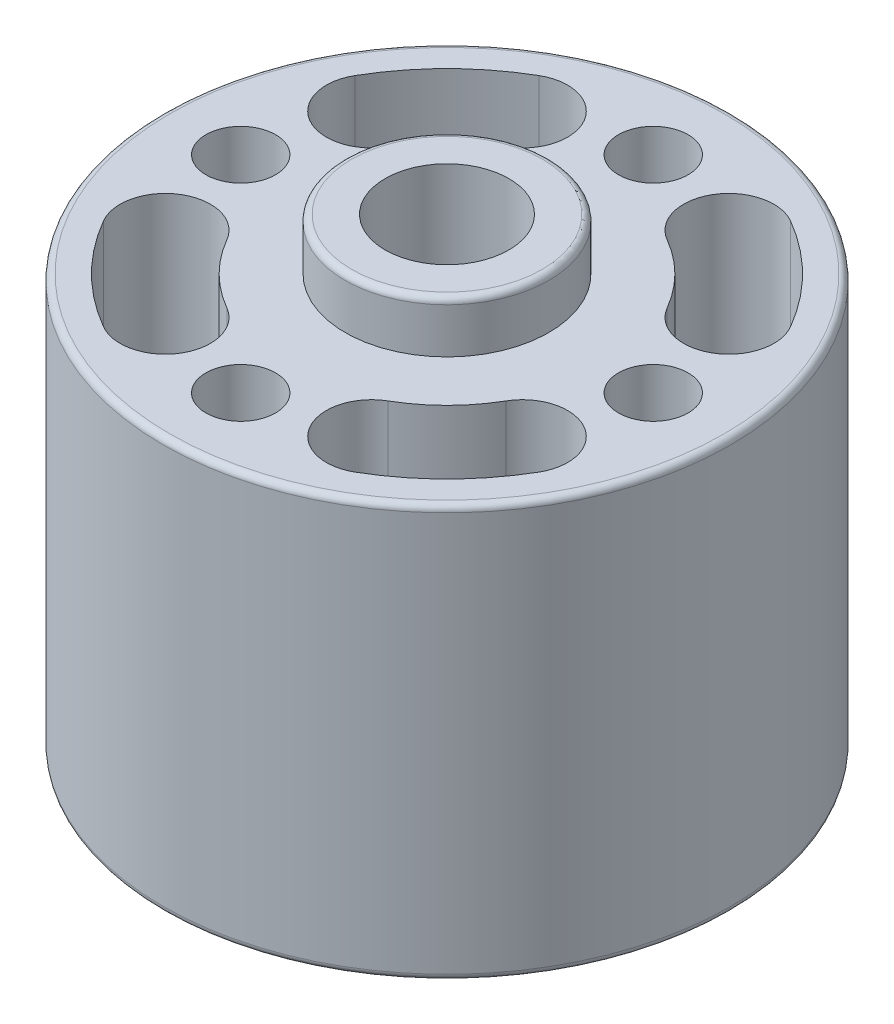
ISO-10303-21;
HEADER;
FILE_DESCRIPTION(('STEP AP214'),'2;1');
FILE_NAME('part.step','',(''),(''),'','','');
FILE_SCHEMA(('AUTOMOTIVE_DESIGN { 1 0 10303 214 1 1 1 1 }'));
ENDSEC;
DATA;
#1=APPLICATION_CONTEXT('core data for automotive mechanical design processes');
#2=APPLICATION_PROTOCOL_DEFINITION('international standard','automotive_design',2000,#1);
#3=PRODUCT_CONTEXT('',#1,'mechanical');
#4=PRODUCT('Part','Part','',(#3));
#5=PRODUCT_RELATED_PRODUCT_CATEGORY('part','',(#4));
#6=PRODUCT_DEFINITION_FORMATION('','',#4);
#7=PRODUCT_DEFINITION_CONTEXT('part definition',#1,'design');
#8=PRODUCT_DEFINITION('design','',#6,#7);
#9=PRODUCT_DEFINITION_SHAPE('','',#8);
#10=(LENGTH_UNIT() NAMED_UNIT(*) SI_UNIT(.MILLI.,.METRE.));
#11=(NAMED_UNIT(*) PLANE_ANGLE_UNIT() SI_UNIT($,.RADIAN.));
#12=(NAMED_UNIT(*) SI_UNIT($,.STERADIAN.) SOLID_ANGLE_UNIT());
#13=UNCERTAINTY_MEASURE_WITH_UNIT(LENGTH_MEASURE(1.E-05),#10,'distance_accuracy_value','');
#14=(GEOMETRIC_REPRESENTATION_CONTEXT(3) GLOBAL_UNCERTAINTY_ASSIGNED_CONTEXT((#13)) GLOBAL_UNIT_ASSIGNED_CONTEXT((#10,
#11,#12)) REPRESENTATION_CONTEXT('',''));
#15=CARTESIAN_POINT('',(0.,0.,0.));
#16=DIRECTION('',(0.,0.,1.));
#17=DIRECTION('',(1.,0.,0.));
#18=AXIS2_PLACEMENT_3D('',#15,#16,#17);
#19=CARTESIAN_POINT('',(0.,-10.,0.));
#20=DIRECTION('',(0.,1.,0.));
#21=DIRECTION('',(0.,0.,1.));
#22=AXIS2_PLACEMENT_3D('',#19,#20,#21);
#23=CYLINDRICAL_SURFACE('',#22,2.4);
#24=CARTESIAN_POINT('',(0.,10.,0.));
#25=DIRECTION('',(0.,1.,0.));
#26=DIRECTION('',(0.,0.,1.));
#27=AXIS2_PLACEMENT_3D('',#24,#25,#26);
#28=CIRCLE('',#27,2.4);
#29=CARTESIAN_POINT('',(0.,10.,2.4));
#30=VERTEX_POINT('',#29);
#31=EDGE_CURVE('E287',#30,#30,#28,.F.);
#32=ORIENTED_EDGE('',*,*,#31,.F.);
#33=EDGE_LOOP('',(#32));
#34=FACE_BOUND('',#33,.T.);
#35=CARTESIAN_POINT('',(0.,-10.,0.));
#36=DIRECTION('',(0.,1.,0.));
#37=DIRECTION('',(0.,0.,1.));
#38=AXIS2_PLACEMENT_3D('',#35,#36,#37);
#39=CIRCLE('',#38,2.4);
#40=CARTESIAN_POINT('',(0.,-10.,2.4));
#41=VERTEX_POINT('',#40);
#42=EDGE_CURVE('E283',#41,#41,#39,.F.);
#43=ORIENTED_EDGE('',*,*,#42,.T.);
#44=EDGE_LOOP('',(#43));
#45=FACE_BOUND('',#44,.T.);
#46=ADVANCED_FACE('F15',(#34,#45),#23,.F.);
#47=CARTESIAN_POINT('',(0.,10.,0.));
#48=DIRECTION('',(0.,1.,0.));
#49=DIRECTION('',(0.,0.,1.));
#50=AXIS2_PLACEMENT_3D('',#47,#48,#49);
#51=PLANE('',#50);
#52=ORIENTED_EDGE('',*,*,#31,.T.);
#53=EDGE_LOOP('',(#52));
#54=FACE_BOUND('',#53,.T.);
#55=CARTESIAN_POINT('',(0.,10.,0.));
#56=DIRECTION('',(0.,-1.,0.));
#57=DIRECTION('',(0.,0.,1.));
#58=AXIS2_PLACEMENT_3D('',#55,#56,#57);
#59=CIRCLE('',#58,3.7);
#60=CARTESIAN_POINT('',(0.,10.,3.7));
#61=VERTEX_POINT('',#60);
#62=CARTESIAN_POINT('',(0.,10.,-3.7));
#63=VERTEX_POINT('',#62);
#64=EDGE_CURVE('E430',#61,#63,#59,.T.);
#65=ORIENTED_EDGE('',*,*,#64,.F.);
#66=CARTESIAN_POINT('',(0.,10.,0.));
#67=DIRECTION('',(0.,-1.,0.));
#68=DIRECTION('',(0.,0.,-1.));
#69=AXIS2_PLACEMENT_3D('',#66,#67,#68);
#70=CIRCLE('',#69,3.7);
#71=EDGE_CURVE('E286',#63,#61,#70,.T.);
#72=ORIENTED_EDGE('',*,*,#71,.F.);
#73=EDGE_LOOP('',(#65,#72));
#74=FACE_BOUND('',#73,.T.);
#75=ADVANCED_FACE('F442',(#54,#74),#51,.T.);
#76=CARTESIAN_POINT('',(0.,-10.,0.));
#77=DIRECTION('',(0.,1.,0.));
#78=DIRECTION('',(0.,0.,1.));
#79=AXIS2_PLACEMENT_3D('',#76,#77,#78);
#80=PLANE('',#79);
#81=ORIENTED_EDGE('',*,*,#42,.F.);
#82=EDGE_LOOP('',(#81));
#83=FACE_BOUND('',#82,.T.);
#84=CARTESIAN_POINT('',(0.,-10.,0.));
#85=DIRECTION('',(0.,1.,0.));
#86=DIRECTION('',(0.,0.,-1.));
#87=AXIS2_PLACEMENT_3D('',#84,#85,#86);
#88=CIRCLE('',#87,3.7);
#89=CARTESIAN_POINT('',(0.,-10.,-3.7));
#90=VERTEX_POINT('',#89);
#91=CARTESIAN_POINT('',(0.,-10.,3.7));
#92=VERTEX_POINT('',#91);
#93=EDGE_CURVE('E282',#90,#92,#88,.T.);
#94=ORIENTED_EDGE('',*,*,#93,.F.);
#95=CARTESIAN_POINT('',(0.,-10.,0.));
#96=DIRECTION('',(0.,1.,0.));
#97=DIRECTION('',(0.,0.,1.));
#98=AXIS2_PLACEMENT_3D('',#95,#96,#97);
#99=CIRCLE('',#98,3.7);
#100=EDGE_CURVE('E443',#92,#90,#99,.T.);
#101=ORIENTED_EDGE('',*,*,#100,.F.);
#102=EDGE_LOOP('',(#94,#101));
#103=FACE_BOUND('',#102,.T.);
#104=ADVANCED_FACE('F459',(#83,#103),#80,.F.);
#105=CARTESIAN_POINT('',(0.,9.75,0.));
#106=DIRECTION('',(0.,1.,0.));
#107=DIRECTION('',(0.,0.,1.));
#108=AXIS2_PLACEMENT_3D('',#105,#106,#107);
#109=TOROIDAL_SURFACE('',#108,3.7,0.25);
#110=ORIENTED_EDGE('',*,*,#71,.T.);
#111=ORIENTED_EDGE('',*,*,#64,.T.);
#112=EDGE_LOOP('',(#110,#111));
#113=FACE_BOUND('',#112,.T.);
#114=CARTESIAN_POINT('',(0.,9.75,0.));
#115=DIRECTION('',(0.,-1.,0.));
#116=DIRECTION('',(0.,0.,-1.));
#117=AXIS2_PLACEMENT_3D('',#114,#115,#116);
#118=CIRCLE('',#117,3.95);
#119=CARTESIAN_POINT('',(0.,9.75,-3.95));
#120=VERTEX_POINT('',#119);
#121=EDGE_CURVE('E278',#120,#120,#118,.T.);
#122=ORIENTED_EDGE('',*,*,#121,.F.);
#123=EDGE_LOOP('',(#122));
#124=FACE_BOUND('',#123,.T.);
#125=ADVANCED_FACE('F406',(#113,#124),#109,.T.);
#126=CARTESIAN_POINT('',(0.,-9.75,0.));
#127=DIRECTION('',(0.,1.,0.));
#128=DIRECTION('',(0.,0.,1.));
#129=AXIS2_PLACEMENT_3D('',#126,#127,#128);
#130=TOROIDAL_SURFACE('',#129,3.7,0.25);
#131=ORIENTED_EDGE('',*,*,#100,.T.);
#132=ORIENTED_EDGE('',*,*,#93,.T.);
#133=EDGE_LOOP('',(#131,#132));
#134=FACE_BOUND('',#133,.T.);
#135=CARTESIAN_POINT('',(0.,-9.75,0.));
#136=DIRECTION('',(0.,-1.,0.));
#137=DIRECTION('',(0.,0.,-1.));
#138=AXIS2_PLACEMENT_3D('',#135,#136,#137);
#139=CIRCLE('',#138,3.95);
#140=CARTESIAN_POINT('',(0.,-9.75,-3.95));
#141=VERTEX_POINT('',#140);
#142=EDGE_CURVE('E274',#141,#141,#139,.F.);
#143=ORIENTED_EDGE('',*,*,#142,.F.);
#144=EDGE_LOOP('',(#143));
#145=FACE_BOUND('',#144,.T.);
#146=ADVANCED_FACE('F401',(#134,#145),#130,.T.);
#147=CARTESIAN_POINT('',(0.,10.,0.));
#148=DIRECTION('',(0.,-1.,0.));
#149=DIRECTION('',(0.,0.,-1.));
#150=AXIS2_PLACEMENT_3D('',#147,#148,#149);
#151=CYLINDRICAL_SURFACE('',#150,3.95);
#152=CARTESIAN_POINT('',(0.,8.,0.));
#153=DIRECTION('',(0.,-1.,0.));
#154=DIRECTION('',(0.,0.,-1.));
#155=AXIS2_PLACEMENT_3D('',#152,#153,#154);
#156=CIRCLE('',#155,3.95);
#157=CARTESIAN_POINT('',(0.,8.,-3.95));
#158=VERTEX_POINT('',#157);
#159=EDGE_CURVE('E215',#158,#158,#156,.T.);
#160=ORIENTED_EDGE('',*,*,#159,.F.);
#161=EDGE_LOOP('',(#160));
#162=FACE_BOUND('',#161,.T.);
#163=ORIENTED_EDGE('',*,*,#121,.T.);
#164=EDGE_LOOP('',(#163));
#165=FACE_BOUND('',#164,.T.);
#166=ADVANCED_FACE('F405',(#162,#165),#151,.T.);
#167=CARTESIAN_POINT('',(0.,-8.,0.));
#168=DIRECTION('',(0.,1.,0.));
#169=DIRECTION('',(0.,0.,1.));
#170=AXIS2_PLACEMENT_3D('',#167,#168,#169);
#171=CYLINDRICAL_SURFACE('',#170,6.25);
#172=DIRECTION('',(0.,1.,0.));
#173=VECTOR('',#172,1.);
#174=CARTESIAN_POINT('',(5.41265877365278,-8.,3.12499999999993));
#175=LINE('',#174,#173);
#176=CARTESIAN_POINT('',(5.41265877365278,-8.,3.12499999999993));
#177=VERTEX_POINT('',#176);
#178=CARTESIAN_POINT('',(5.41265877365278,8.,3.12499999999993));
#179=VERTEX_POINT('',#178);
#180=EDGE_CURVE('E281',#177,#179,#175,.T.);
#181=ORIENTED_EDGE('',*,*,#180,.T.);
#182=CARTESIAN_POINT('',(0.,8.,0.));
#183=DIRECTION('',(0.,1.,0.));
#184=DIRECTION('',(0.,0.,1.));
#185=AXIS2_PLACEMENT_3D('',#182,#183,#184);
#186=CIRCLE('',#185,6.25);
#187=CARTESIAN_POINT('',(3.12500000000005,8.,5.41265877365271));
#188=VERTEX_POINT('',#187);
#189=EDGE_CURVE('E271',#188,#179,#186,.T.);
#190=ORIENTED_EDGE('',*,*,#189,.F.);
#191=DIRECTION('',(0.,1.,0.));
#192=VECTOR('',#191,1.);
#193=CARTESIAN_POINT('',(3.12500000000005,-8.,5.41265877365271));
#194=LINE('',#193,#192);
#195=CARTESIAN_POINT('',(3.12500000000005,-8.,5.41265877365271));
#196=VERTEX_POINT('',#195);
#197=EDGE_CURVE('E389',#188,#196,#194,.F.);
#198=ORIENTED_EDGE('',*,*,#197,.T.);
#199=CARTESIAN_POINT('',(0.,-8.,0.));
#200=DIRECTION('',(0.,1.,0.));
#201=DIRECTION('',(0.,0.,1.));
#202=AXIS2_PLACEMENT_3D('',#199,#200,#201);
#203=CIRCLE('',#202,6.25);
#204=EDGE_CURVE('E212',#196,#177,#203,.T.);
#205=ORIENTED_EDGE('',*,*,#204,.T.);
#206=EDGE_LOOP('',(#181,#190,#198,#205));
#207=FACE_BOUND('',#206,.T.);
#208=ADVANCED_FACE('F516',(#207),#171,.T.);
#209=CARTESIAN_POINT('',(6.92820323027556,-8.,3.99999999999991));
#210=DIRECTION('',(0.,1.,0.));
#211=DIRECTION('',(0.,0.,1.));
#212=AXIS2_PLACEMENT_3D('',#209,#210,#211);
#213=CYLINDRICAL_SURFACE('',#212,1.75);
#214=ORIENTED_EDGE('',*,*,#180,.F.);
#215=CARTESIAN_POINT('',(6.92820323027556,-8.,3.99999999999991));
#216=DIRECTION('',(0.,1.,0.));
#217=DIRECTION('',(0.,0.,1.));
#218=AXIS2_PLACEMENT_3D('',#215,#216,#217);
#219=CIRCLE('',#218,1.75);
#220=CARTESIAN_POINT('',(8.44374768689834,-8.,4.8749999999999));
#221=VERTEX_POINT('',#220);
#222=EDGE_CURVE('E210',#177,#221,#219,.F.);
#223=ORIENTED_EDGE('',*,*,#222,.T.);
#224=DIRECTION('',(0.,1.,0.));
#225=VECTOR('',#224,1.);
#226=CARTESIAN_POINT('',(8.44374768689833,-8.,4.87499999999991));
#227=LINE('',#226,#225);
#228=CARTESIAN_POINT('',(8.44374768689834,8.,4.8749999999999));
#229=VERTEX_POINT('',#228);
#230=EDGE_CURVE('E391',#221,#229,#227,.T.);
#231=ORIENTED_EDGE('',*,*,#230,.T.);
#232=CARTESIAN_POINT('',(6.92820323027556,8.,3.99999999999991));
#233=DIRECTION('',(0.,1.,0.));
#234=DIRECTION('',(0.,0.,1.));
#235=AXIS2_PLACEMENT_3D('',#232,#233,#234);
#236=CIRCLE('',#235,1.75);
#237=EDGE_CURVE('E268',#179,#229,#236,.F.);
#238=ORIENTED_EDGE('',*,*,#237,.F.);
#239=EDGE_LOOP('',(#214,#223,#231,#238));
#240=FACE_BOUND('',#239,.T.);
#241=ADVANCED_FACE('F519',(#240),#213,.F.);
#242=CARTESIAN_POINT('',(0.,-8.,0.));
#243=DIRECTION('',(0.,1.,0.));
#244=DIRECTION('',(0.,0.,1.));
#245=AXIS2_PLACEMENT_3D('',#242,#243,#244);
#246=CYLINDRICAL_SURFACE('',#245,9.75);
#247=CARTESIAN_POINT('',(0.,-8.,0.));
#248=DIRECTION('',(0.,1.,0.));
#249=DIRECTION('',(0.,0.,1.));
#250=AXIS2_PLACEMENT_3D('',#247,#248,#249);
#251=CIRCLE('',#250,9.75);
#252=CARTESIAN_POINT('',(4.87500000000008,-8.,8.44374768689823));
#253=VERTEX_POINT('',#252);
#254=EDGE_CURVE('E207',#221,#253,#251,.F.);
#255=ORIENTED_EDGE('',*,*,#254,.T.);
#256=DIRECTION('',(0.,1.,0.));
#257=VECTOR('',#256,1.);
#258=CARTESIAN_POINT('',(4.87500000000008,-8.,8.44374768689823));
#259=LINE('',#258,#257);
#260=CARTESIAN_POINT('',(4.87500000000008,8.,8.44374768689823));
#261=VERTEX_POINT('',#260);
#262=EDGE_CURVE('E388',#253,#261,#259,.T.);
#263=ORIENTED_EDGE('',*,*,#262,.T.);
#264=CARTESIAN_POINT('',(0.,8.,0.));
#265=DIRECTION('',(0.,1.,0.));
#266=DIRECTION('',(0.,0.,1.));
#267=AXIS2_PLACEMENT_3D('',#264,#265,#266);
#268=CIRCLE('',#267,9.75);
#269=EDGE_CURVE('E265',#229,#261,#268,.F.);
#270=ORIENTED_EDGE('',*,*,#269,.F.);
#271=ORIENTED_EDGE('',*,*,#230,.F.);
#272=EDGE_LOOP('',(#255,#263,#270,#271));
#273=FACE_BOUND('',#272,.T.);
#274=ADVANCED_FACE('F508',(#273),#246,.F.);
#275=CARTESIAN_POINT('',(4.00000000000006,-8.,6.92820323027547));
#276=DIRECTION('',(0.,1.,0.));
#277=DIRECTION('',(0.,0.,1.));
#278=AXIS2_PLACEMENT_3D('',#275,#276,#277);
#279=CYLINDRICAL_SURFACE('',#278,1.75);
#280=ORIENTED_EDGE('',*,*,#262,.F.);
#281=CARTESIAN_POINT('',(4.00000000000006,-8.,6.92820323027547));
#282=DIRECTION('',(0.,1.,0.));
#283=DIRECTION('',(0.,0.,1.));
#284=AXIS2_PLACEMENT_3D('',#281,#282,#283);
#285=CIRCLE('',#284,1.75);
#286=EDGE_CURVE('E204',#253,#196,#285,.F.);
#287=ORIENTED_EDGE('',*,*,#286,.T.);
#288=ORIENTED_EDGE('',*,*,#197,.F.);
#289=CARTESIAN_POINT('',(4.00000000000006,8.,6.92820323027547));
#290=DIRECTION('',(0.,1.,0.));
#291=DIRECTION('',(0.,0.,1.));
#292=AXIS2_PLACEMENT_3D('',#289,#290,#291);
#293=CIRCLE('',#292,1.75);
#294=EDGE_CURVE('E263',#261,#188,#293,.F.);
#295=ORIENTED_EDGE('',*,*,#294,.F.);
#296=EDGE_LOOP('',(#280,#287,#288,#295));
#297=FACE_BOUND('',#296,.T.);
#298=ADVANCED_FACE('F512',(#297),#279,.F.);
#299=CARTESIAN_POINT('',(0.,-8.,0.));
#300=DIRECTION('',(0.,1.,0.));
#301=DIRECTION('',(0.,0.,1.));
#302=AXIS2_PLACEMENT_3D('',#299,#300,#301);
#303=CYLINDRICAL_SURFACE('',#302,6.25);
#304=DIRECTION('',(0.,1.,0.));
#305=VECTOR('',#304,1.);
#306=CARTESIAN_POINT('',(-3.12499999999999,-8.,5.41265877365275));
#307=LINE('',#306,#305);
#308=CARTESIAN_POINT('',(-3.12499999999999,-8.,5.41265877365275));
#309=VERTEX_POINT('',#308);
#310=CARTESIAN_POINT('',(-3.12499999999999,8.,5.41265877365275));
#311=VERTEX_POINT('',#310);
#312=EDGE_CURVE('E385',#309,#311,#307,.T.);
#313=ORIENTED_EDGE('',*,*,#312,.T.);
#314=CARTESIAN_POINT('',(0.,8.,0.));
#315=DIRECTION('',(0.,1.,0.));
#316=DIRECTION('',(0.,0.,1.));
#317=AXIS2_PLACEMENT_3D('',#314,#315,#316);
#318=CIRCLE('',#317,6.25);
#319=CARTESIAN_POINT('',(-5.41265877365274,8.,3.12499999999999));
#320=VERTEX_POINT('',#319);
#321=EDGE_CURVE('E260',#320,#311,#318,.T.);
#322=ORIENTED_EDGE('',*,*,#321,.F.);
#323=DIRECTION('',(0.,1.,0.));
#324=VECTOR('',#323,1.);
#325=CARTESIAN_POINT('',(-5.41265877365274,-8.,3.12499999999999));
#326=LINE('',#325,#324);
#327=CARTESIAN_POINT('',(-5.41265877365274,-8.,3.12499999999999));
#328=VERTEX_POINT('',#327);
#329=EDGE_CURVE('E380',#320,#328,#326,.F.);
#330=ORIENTED_EDGE('',*,*,#329,.T.);
#331=CARTESIAN_POINT('',(0.,-8.,0.));
#332=DIRECTION('',(0.,1.,0.));
#333=DIRECTION('',(0.,0.,1.));
#334=AXIS2_PLACEMENT_3D('',#331,#332,#333);
#335=CIRCLE('',#334,6.25);
#336=EDGE_CURVE('E202',#328,#309,#335,.T.);
#337=ORIENTED_EDGE('',*,*,#336,.T.);
#338=EDGE_LOOP('',(#313,#322,#330,#337));
#339=FACE_BOUND('',#338,.T.);
#340=ADVANCED_FACE('F642',(#339),#303,.T.);
#341=CARTESIAN_POINT('',(-3.99999999999998,-8.,6.92820323027552));
#342=DIRECTION('',(0.,1.,0.));
#343=DIRECTION('',(0.,0.,1.));
#344=AXIS2_PLACEMENT_3D('',#341,#342,#343);
#345=CYLINDRICAL_SURFACE('',#344,1.75);
#346=ORIENTED_EDGE('',*,*,#312,.F.);
#347=CARTESIAN_POINT('',(-3.99999999999998,-8.,6.92820323027552));
#348=DIRECTION('',(0.,1.,0.));
#349=DIRECTION('',(0.,0.,1.));
#350=AXIS2_PLACEMENT_3D('',#347,#348,#349);
#351=CIRCLE('',#350,1.75);
#352=CARTESIAN_POINT('',(-4.87499999999999,-8.,8.44374768689828));
#353=VERTEX_POINT('',#352);
#354=EDGE_CURVE('E199',#309,#353,#351,.F.);
#355=ORIENTED_EDGE('',*,*,#354,.T.);
#356=DIRECTION('',(0.,1.,0.));
#357=VECTOR('',#356,1.);
#358=CARTESIAN_POINT('',(-4.875,-8.,8.44374768689828));
#359=LINE('',#358,#357);
#360=CARTESIAN_POINT('',(-4.87499999999999,8.,8.44374768689828));
#361=VERTEX_POINT('',#360);
#362=EDGE_CURVE('E382',#353,#361,#359,.T.);
#363=ORIENTED_EDGE('',*,*,#362,.T.);
#364=CARTESIAN_POINT('',(-3.99999999999998,8.,6.92820323027552));
#365=DIRECTION('',(0.,1.,0.));
#366=DIRECTION('',(0.,0.,1.));
#367=AXIS2_PLACEMENT_3D('',#364,#365,#366);
#368=CIRCLE('',#367,1.75);
#369=EDGE_CURVE('E257',#311,#361,#368,.F.);
#370=ORIENTED_EDGE('',*,*,#369,.F.);
#371=EDGE_LOOP('',(#346,#355,#363,#370));
#372=FACE_BOUND('',#371,.T.);
#373=ADVANCED_FACE('F652',(#372),#345,.F.);
#374=CARTESIAN_POINT('',(0.,-8.,0.));
#375=DIRECTION('',(0.,1.,0.));
#376=DIRECTION('',(0.,0.,1.));
#377=AXIS2_PLACEMENT_3D('',#374,#375,#376);
#378=CYLINDRICAL_SURFACE('',#377,9.75);
#379=CARTESIAN_POINT('',(0.,-8.,0.));
#380=DIRECTION('',(0.,1.,0.));
#381=DIRECTION('',(0.,0.,1.));
#382=AXIS2_PLACEMENT_3D('',#379,#380,#381);
#383=CIRCLE('',#382,9.75);
#384=CARTESIAN_POINT('',(-8.44374768689828,-8.,4.87499999999999));
#385=VERTEX_POINT('',#384);
#386=EDGE_CURVE('E197',#353,#385,#383,.F.);
#387=ORIENTED_EDGE('',*,*,#386,.T.);
#388=DIRECTION('',(0.,1.,0.));
#389=VECTOR('',#388,1.);
#390=CARTESIAN_POINT('',(-8.44374768689828,-8.,4.87499999999999));
#391=LINE('',#390,#389);
#392=CARTESIAN_POINT('',(-8.44374768689828,8.,4.87499999999999));
#393=VERTEX_POINT('',#392);
#394=EDGE_CURVE('E379',#385,#393,#391,.T.);
#395=ORIENTED_EDGE('',*,*,#394,.T.);
#396=CARTESIAN_POINT('',(0.,8.,0.));
#397=DIRECTION('',(0.,1.,0.));
#398=DIRECTION('',(0.,0.,1.));
#399=AXIS2_PLACEMENT_3D('',#396,#397,#398);
#400=CIRCLE('',#399,9.75);
#401=EDGE_CURVE('E254',#361,#393,#400,.F.);
#402=ORIENTED_EDGE('',*,*,#401,.F.);
#403=ORIENTED_EDGE('',*,*,#362,.F.);
#404=EDGE_LOOP('',(#387,#395,#402,#403));
#405=FACE_BOUND('',#404,.T.);
#406=ADVANCED_FACE('F663',(#405),#378,.F.);
#407=CARTESIAN_POINT('',(-6.92820323027551,-8.,3.99999999999999));
#408=DIRECTION('',(0.,1.,0.));
#409=DIRECTION('',(0.,0.,1.));
#410=AXIS2_PLACEMENT_3D('',#407,#408,#409);
#411=CYLINDRICAL_SURFACE('',#410,1.75);
#412=CARTESIAN_POINT('',(-6.92820323027551,-8.,3.99999999999999));
#413=DIRECTION('',(0.,1.,0.));
#414=DIRECTION('',(0.,0.,1.));
#415=AXIS2_PLACEMENT_3D('',#412,#413,#414);
#416=CIRCLE('',#415,1.75);
#417=EDGE_CURVE('E194',#385,#328,#416,.F.);
#418=ORIENTED_EDGE('',*,*,#417,.T.);
#419=ORIENTED_EDGE('',*,*,#329,.F.);
#420=CARTESIAN_POINT('',(-6.92820323027551,8.,3.99999999999999));
#421=DIRECTION('',(0.,1.,0.));
#422=DIRECTION('',(0.,0.,1.));
#423=AXIS2_PLACEMENT_3D('',#420,#421,#422);
#424=CIRCLE('',#423,1.75);
#425=EDGE_CURVE('E251',#393,#320,#424,.F.);
#426=ORIENTED_EDGE('',*,*,#425,.F.);
#427=ORIENTED_EDGE('',*,*,#394,.F.);
#428=EDGE_LOOP('',(#418,#419,#426,#427));
#429=FACE_BOUND('',#428,.T.);
#430=ADVANCED_FACE('F674',(#429),#411,.F.);
#431=CARTESIAN_POINT('',(0.,-8.,0.));
#432=DIRECTION('',(0.,1.,0.));
#433=DIRECTION('',(0.,0.,1.));
#434=AXIS2_PLACEMENT_3D('',#431,#432,#433);
#435=CYLINDRICAL_SURFACE('',#434,6.25);
#436=DIRECTION('',(0.,1.,0.));
#437=VECTOR('',#436,1.);
#438=CARTESIAN_POINT('',(-5.41265877365276,-8.,-3.12499999999997));
#439=LINE('',#438,#437);
#440=CARTESIAN_POINT('',(-5.41265877365276,-8.,-3.12499999999997));
#441=VERTEX_POINT('',#440);
#442=CARTESIAN_POINT('',(-5.41265877365276,8.,-3.12499999999997));
#443=VERTEX_POINT('',#442);
#444=EDGE_CURVE('E376',#441,#443,#439,.T.);
#445=ORIENTED_EDGE('',*,*,#444,.T.);
#446=CARTESIAN_POINT('',(0.,8.,0.));
#447=DIRECTION('',(0.,1.,0.));
#448=DIRECTION('',(0.,0.,1.));
#449=AXIS2_PLACEMENT_3D('',#446,#447,#448);
#450=CIRCLE('',#449,6.25);
#451=CARTESIAN_POINT('',(-3.12500000000001,8.,-5.41265877365273));
#452=VERTEX_POINT('',#451);
#453=EDGE_CURVE('E248',#452,#443,#450,.T.);
#454=ORIENTED_EDGE('',*,*,#453,.F.);
#455=DIRECTION('',(0.,1.,0.));
#456=VECTOR('',#455,1.);
#457=CARTESIAN_POINT('',(-3.12500000000001,-8.,-5.41265877365273));
#458=LINE('',#457,#456);
#459=CARTESIAN_POINT('',(-3.12500000000001,-8.,-5.41265877365273));
#460=VERTEX_POINT('',#459);
#461=EDGE_CURVE('E371',#452,#460,#458,.F.);
#462=ORIENTED_EDGE('',*,*,#461,.T.);
#463=CARTESIAN_POINT('',(0.,-8.,0.));
#464=DIRECTION('',(0.,1.,0.));
#465=DIRECTION('',(0.,0.,1.));
#466=AXIS2_PLACEMENT_3D('',#463,#464,#465);
#467=CIRCLE('',#466,6.25);
#468=EDGE_CURVE('E191',#460,#441,#467,.T.);
#469=ORIENTED_EDGE('',*,*,#468,.T.);
#470=EDGE_LOOP('',(#445,#454,#462,#469));
#471=FACE_BOUND('',#470,.T.);
#472=ADVANCED_FACE('F685',(#471),#435,.T.);
#473=CARTESIAN_POINT('',(-6.92820323027553,-8.,-3.99999999999996));
#474=DIRECTION('',(0.,1.,0.));
#475=DIRECTION('',(0.,0.,1.));
#476=AXIS2_PLACEMENT_3D('',#473,#474,#475);
#477=CYLINDRICAL_SURFACE('',#476,1.75);
#478=ORIENTED_EDGE('',*,*,#444,.F.);
#479=CARTESIAN_POINT('',(-6.92820323027553,-8.,-3.99999999999996));
#480=DIRECTION('',(0.,1.,0.));
#481=DIRECTION('',(0.,0.,1.));
#482=AXIS2_PLACEMENT_3D('',#479,#480,#481);
#483=CIRCLE('',#482,1.75);
#484=CARTESIAN_POINT('',(-8.4437476868983,-8.,-4.87499999999996));
#485=VERTEX_POINT('',#484);
#486=EDGE_CURVE('E189',#441,#485,#483,.F.);
#487=ORIENTED_EDGE('',*,*,#486,.T.);
#488=DIRECTION('',(0.,1.,0.));
#489=VECTOR('',#488,1.);
#490=CARTESIAN_POINT('',(-8.4437476868983,-8.,-4.87499999999997));
#491=LINE('',#490,#489);
#492=CARTESIAN_POINT('',(-8.4437476868983,8.,-4.87499999999996));
#493=VERTEX_POINT('',#492);
#494=EDGE_CURVE('E373',#485,#493,#491,.T.);
#495=ORIENTED_EDGE('',*,*,#494,.T.);
#496=CARTESIAN_POINT('',(-6.92820323027553,8.,-3.99999999999996));
#497=DIRECTION('',(0.,1.,0.));
#498=DIRECTION('',(0.,0.,1.));
#499=AXIS2_PLACEMENT_3D('',#496,#497,#498);
#500=CIRCLE('',#499,1.75);
#501=EDGE_CURVE('E245',#443,#493,#500,.F.);
#502=ORIENTED_EDGE('',*,*,#501,.F.);
#503=EDGE_LOOP('',(#478,#487,#495,#502));
#504=FACE_BOUND('',#503,.T.);
#505=ADVANCED_FACE('F696',(#504),#477,.F.);
#506=CARTESIAN_POINT('',(0.,-8.,0.));
#507=DIRECTION('',(0.,1.,0.));
#508=DIRECTION('',(0.,0.,1.));
#509=AXIS2_PLACEMENT_3D('',#506,#507,#508);
#510=CYLINDRICAL_SURFACE('',#509,9.75);
#511=CARTESIAN_POINT('',(0.,-8.,0.));
#512=DIRECTION('',(0.,1.,0.));
#513=DIRECTION('',(0.,0.,1.));
#514=AXIS2_PLACEMENT_3D('',#511,#512,#513);
#515=CIRCLE('',#514,9.75);
#516=CARTESIAN_POINT('',(-4.87500000000002,-8.,-8.44374768689826));
#517=VERTEX_POINT('',#516);
#518=EDGE_CURVE('E186',#485,#517,#515,.F.);
#519=ORIENTED_EDGE('',*,*,#518,.T.);
#520=DIRECTION('',(0.,1.,0.));
#521=VECTOR('',#520,1.);
#522=CARTESIAN_POINT('',(-4.87500000000002,-8.,-8.44374768689826));
#523=LINE('',#522,#521);
#524=CARTESIAN_POINT('',(-4.87500000000002,8.,-8.44374768689826));
#525=VERTEX_POINT('',#524);
#526=EDGE_CURVE('E370',#517,#525,#523,.T.);
#527=ORIENTED_EDGE('',*,*,#526,.T.);
#528=CARTESIAN_POINT('',(0.,8.,0.));
#529=DIRECTION('',(0.,1.,0.));
#530=DIRECTION('',(0.,0.,1.));
#531=AXIS2_PLACEMENT_3D('',#528,#529,#530);
#532=CIRCLE('',#531,9.75);
#533=EDGE_CURVE('E242',#493,#525,#532,.F.);
#534=ORIENTED_EDGE('',*,*,#533,.F.);
#535=ORIENTED_EDGE('',*,*,#494,.F.);
#536=EDGE_LOOP('',(#519,#527,#534,#535));
#537=FACE_BOUND('',#536,.T.);
#538=ADVANCED_FACE('F707',(#537),#510,.F.);
#539=CARTESIAN_POINT('',(-4.00000000000002,-8.,-6.9282032302755));
#540=DIRECTION('',(0.,1.,0.));
#541=DIRECTION('',(0.,0.,1.));
#542=AXIS2_PLACEMENT_3D('',#539,#540,#541);
#543=CYLINDRICAL_SURFACE('',#542,1.75);
#544=ORIENTED_EDGE('',*,*,#526,.F.);
#545=CARTESIAN_POINT('',(-4.00000000000002,-8.,-6.9282032302755));
#546=DIRECTION('',(0.,1.,0.));
#547=DIRECTION('',(0.,0.,1.));
#548=AXIS2_PLACEMENT_3D('',#545,#546,#547);
#549=CIRCLE('',#548,1.75);
#550=EDGE_CURVE('E183',#517,#460,#549,.F.);
#551=ORIENTED_EDGE('',*,*,#550,.T.);
#552=ORIENTED_EDGE('',*,*,#461,.F.);
#553=CARTESIAN_POINT('',(-4.00000000000002,8.,-6.9282032302755));
#554=DIRECTION('',(0.,1.,0.));
#555=DIRECTION('',(0.,0.,1.));
#556=AXIS2_PLACEMENT_3D('',#553,#554,#555);
#557=CIRCLE('',#556,1.75);
#558=EDGE_CURVE('E240',#525,#452,#557,.F.);
#559=ORIENTED_EDGE('',*,*,#558,.F.);
#560=EDGE_LOOP('',(#544,#551,#552,#559));
#561=FACE_BOUND('',#560,.T.);
#562=ADVANCED_FACE('F718',(#561),#543,.F.);
#563=CARTESIAN_POINT('',(0.,-8.,0.));
#564=DIRECTION('',(0.,1.,0.));
#565=DIRECTION('',(0.,0.,1.));
#566=AXIS2_PLACEMENT_3D('',#563,#564,#565);
#567=CYLINDRICAL_SURFACE('',#566,6.25);
#568=DIRECTION('',(0.,1.,0.));
#569=VECTOR('',#568,1.);
#570=CARTESIAN_POINT('',(3.12499999999999,-8.,-5.41265877365275));
#571=LINE('',#570,#569);
#572=CARTESIAN_POINT('',(3.12499999999999,-8.,-5.41265877365275));
#573=VERTEX_POINT('',#572);
#574=CARTESIAN_POINT('',(3.12499999999999,8.,-5.41265877365275));
#575=VERTEX_POINT('',#574);
#576=EDGE_CURVE('E157',#573,#575,#571,.T.);
#577=ORIENTED_EDGE('',*,*,#576,.T.);
#578=CARTESIAN_POINT('',(0.,8.,0.));
#579=DIRECTION('',(0.,1.,0.));
#580=DIRECTION('',(0.,0.,1.));
#581=AXIS2_PLACEMENT_3D('',#578,#579,#580);
#582=CIRCLE('',#581,6.25);
#583=CARTESIAN_POINT('',(5.41265877365274,8.,-3.12499999999999));
#584=VERTEX_POINT('',#583);
#585=EDGE_CURVE('E237',#584,#575,#582,.T.);
#586=ORIENTED_EDGE('',*,*,#585,.F.);
#587=DIRECTION('',(0.,1.,0.));
#588=VECTOR('',#587,1.);
#589=CARTESIAN_POINT('',(5.41265877365274,-8.,-3.12499999999999));
#590=LINE('',#589,#588);
#591=CARTESIAN_POINT('',(5.41265877365274,-8.,-3.12499999999999));
#592=VERTEX_POINT('',#591);
#593=EDGE_CURVE('E170',#584,#592,#590,.F.);
#594=ORIENTED_EDGE('',*,*,#593,.T.);
#595=CARTESIAN_POINT('',(0.,-8.,0.));
#596=DIRECTION('',(0.,1.,0.));
#597=DIRECTION('',(0.,0.,1.));
#598=AXIS2_PLACEMENT_3D('',#595,#596,#597);
#599=CIRCLE('',#598,6.25);
#600=EDGE_CURVE('E162',#592,#573,#599,.T.);
#601=ORIENTED_EDGE('',*,*,#600,.T.);
#602=EDGE_LOOP('',(#577,#586,#594,#601));
#603=FACE_BOUND('',#602,.T.);
#604=ADVANCED_FACE('F729',(#603),#567,.T.);
#605=CARTESIAN_POINT('',(3.99999999999998,-8.,-6.92820323027552));
#606=DIRECTION('',(0.,1.,0.));
#607=DIRECTION('',(0.,0.,1.));
#608=AXIS2_PLACEMENT_3D('',#605,#606,#607);
#609=CYLINDRICAL_SURFACE('',#608,1.75);
#610=ORIENTED_EDGE('',*,*,#576,.F.);
#611=CARTESIAN_POINT('',(3.99999999999998,-8.,-6.92820323027552));
#612=DIRECTION('',(0.,1.,0.));
#613=DIRECTION('',(0.,0.,1.));
#614=AXIS2_PLACEMENT_3D('',#611,#612,#613);
#615=CIRCLE('',#614,1.75);
#616=CARTESIAN_POINT('',(4.87499999999999,-8.,-8.44374768689828));
#617=VERTEX_POINT('',#616);
#618=EDGE_CURVE('E151',#573,#617,#615,.F.);
#619=ORIENTED_EDGE('',*,*,#618,.T.);
#620=DIRECTION('',(0.,1.,0.));
#621=VECTOR('',#620,1.);
#622=CARTESIAN_POINT('',(4.875,-8.,-8.44374768689828));
#623=LINE('',#622,#621);
#624=CARTESIAN_POINT('',(4.87499999999999,8.,-8.44374768689828));
#625=VERTEX_POINT('',#624);
#626=EDGE_CURVE('E154',#617,#625,#623,.T.);
#627=ORIENTED_EDGE('',*,*,#626,.T.);
#628=CARTESIAN_POINT('',(3.99999999999998,8.,-6.92820323027552));
#629=DIRECTION('',(0.,1.,0.));
#630=DIRECTION('',(0.,0.,1.));
#631=AXIS2_PLACEMENT_3D('',#628,#629,#630);
#632=CIRCLE('',#631,1.75);
#633=EDGE_CURVE('E235',#575,#625,#632,.F.);
#634=ORIENTED_EDGE('',*,*,#633,.F.);
#635=EDGE_LOOP('',(#610,#619,#627,#634));
#636=FACE_BOUND('',#635,.T.);
#637=ADVANCED_FACE('F153',(#636),#609,.F.);
#638=CARTESIAN_POINT('',(0.,-8.,0.));
#639=DIRECTION('',(0.,1.,0.));
#640=DIRECTION('',(0.,0.,1.));
#641=AXIS2_PLACEMENT_3D('',#638,#639,#640);
#642=CYLINDRICAL_SURFACE('',#641,9.75);
#643=CARTESIAN_POINT('',(0.,-8.,0.));
#644=DIRECTION('',(0.,1.,0.));
#645=DIRECTION('',(0.,0.,1.));
#646=AXIS2_PLACEMENT_3D('',#643,#644,#645);
#647=CIRCLE('',#646,9.75);
#648=CARTESIAN_POINT('',(8.44374768689828,-8.,-4.87499999999999));
#649=VERTEX_POINT('',#648);
#650=EDGE_CURVE('E161',#617,#649,#647,.F.);
#651=ORIENTED_EDGE('',*,*,#650,.T.);
#652=DIRECTION('',(0.,1.,0.));
#653=VECTOR('',#652,1.);
#654=CARTESIAN_POINT('',(8.44374768689828,-8.,-4.87499999999999));
#655=LINE('',#654,#653);
#656=CARTESIAN_POINT('',(8.44374768689828,8.,-4.87499999999999));
#657=VERTEX_POINT('',#656);
#658=EDGE_CURVE('E277',#649,#657,#655,.T.);
#659=ORIENTED_EDGE('',*,*,#658,.T.);
#660=CARTESIAN_POINT('',(0.,8.,0.));
#661=DIRECTION('',(0.,1.,0.));
#662=DIRECTION('',(0.,0.,1.));
#663=AXIS2_PLACEMENT_3D('',#660,#661,#662);
#664=CIRCLE('',#663,9.75);
#665=EDGE_CURVE('E168',#625,#657,#664,.F.);
#666=ORIENTED_EDGE('',*,*,#665,.F.);
#667=ORIENTED_EDGE('',*,*,#626,.F.);
#668=EDGE_LOOP('',(#651,#659,#666,#667));
#669=FACE_BOUND('',#668,.T.);
#670=ADVANCED_FACE('F165',(#669),#642,.F.);
#671=CARTESIAN_POINT('',(6.92820323027551,-8.,-3.99999999999999));
#672=DIRECTION('',(0.,1.,0.));
#673=DIRECTION('',(0.,0.,1.));
#674=AXIS2_PLACEMENT_3D('',#671,#672,#673);
#675=CYLINDRICAL_SURFACE('',#674,1.75);
#676=CARTESIAN_POINT('',(6.92820323027551,-8.,-3.99999999999999));
#677=DIRECTION('',(0.,1.,0.));
#678=DIRECTION('',(0.,0.,1.));
#679=AXIS2_PLACEMENT_3D('',#676,#677,#678);
#680=CIRCLE('',#679,1.75);
#681=EDGE_CURVE('E176',#649,#592,#680,.F.);
#682=ORIENTED_EDGE('',*,*,#681,.T.);
#683=ORIENTED_EDGE('',*,*,#593,.F.);
#684=CARTESIAN_POINT('',(6.92820323027551,8.,-3.99999999999999));
#685=DIRECTION('',(0.,1.,0.));
#686=DIRECTION('',(0.,0.,1.));
#687=AXIS2_PLACEMENT_3D('',#684,#685,#686);
#688=CIRCLE('',#687,1.75);
#689=EDGE_CURVE('E231',#657,#584,#688,.F.);
#690=ORIENTED_EDGE('',*,*,#689,.F.);
#691=ORIENTED_EDGE('',*,*,#658,.F.);
#692=EDGE_LOOP('',(#682,#683,#690,#691));
#693=FACE_BOUND('',#692,.T.);
#694=ADVANCED_FACE('F490',(#693),#675,.F.);
#695=CARTESIAN_POINT('',(-8.,-12.,0.));
#696=DIRECTION('',(0.,1.,0.));
#697=DIRECTION('',(0.,0.,1.));
#698=AXIS2_PLACEMENT_3D('',#695,#696,#697);
#699=CYLINDRICAL_SURFACE('',#698,1.35);
#700=CARTESIAN_POINT('',(-8.,-8.,0.));
#701=DIRECTION('',(0.,1.,0.));
#702=DIRECTION('',(0.,0.,1.));
#703=AXIS2_PLACEMENT_3D('',#700,#701,#702);
#704=CIRCLE('',#703,1.35);
#705=CARTESIAN_POINT('',(-8.,-8.,1.35));
#706=VERTEX_POINT('',#705);
#707=EDGE_CURVE('E178',#706,#706,#704,.F.);
#708=ORIENTED_EDGE('',*,*,#707,.T.);
#709=EDGE_LOOP('',(#708));
#710=FACE_BOUND('',#709,.T.);
#711=CARTESIAN_POINT('',(-8.,8.,0.));
#712=DIRECTION('',(0.,1.,0.));
#713=DIRECTION('',(0.,0.,1.));
#714=AXIS2_PLACEMENT_3D('',#711,#712,#713);
#715=CIRCLE('',#714,1.35);
#716=CARTESIAN_POINT('',(-8.,8.,1.35));
#717=VERTEX_POINT('',#716);
#718=EDGE_CURVE('E228',#717,#717,#715,.F.);
#719=ORIENTED_EDGE('',*,*,#718,.F.);
#720=EDGE_LOOP('',(#719));
#721=FACE_BOUND('',#720,.T.);
#722=ADVANCED_FACE('F485',(#710,#721),#699,.F.);
#723=CARTESIAN_POINT('',(0.,-12.,8.));
#724=DIRECTION('',(0.,1.,0.));
#725=DIRECTION('',(0.,0.,1.));
#726=AXIS2_PLACEMENT_3D('',#723,#724,#725);
#727=CYLINDRICAL_SURFACE('',#726,1.35);
#728=CARTESIAN_POINT('',(0.,-8.,8.));
#729=DIRECTION('',(0.,1.,0.));
#730=DIRECTION('',(0.,0.,1.));
#731=AXIS2_PLACEMENT_3D('',#728,#729,#730);
#732=CIRCLE('',#731,1.35);
#733=CARTESIAN_POINT('',(0.,-8.,9.35));
#734=VERTEX_POINT('',#733);
#735=EDGE_CURVE('E480',#734,#734,#732,.F.);
#736=ORIENTED_EDGE('',*,*,#735,.T.);
#737=EDGE_LOOP('',(#736));
#738=FACE_BOUND('',#737,.T.);
#739=CARTESIAN_POINT('',(0.,8.,8.));
#740=DIRECTION('',(0.,1.,0.));
#741=DIRECTION('',(0.,0.,1.));
#742=AXIS2_PLACEMENT_3D('',#739,#740,#741);
#743=CIRCLE('',#742,1.35);
#744=CARTESIAN_POINT('',(0.,8.,9.35));
#745=VERTEX_POINT('',#744);
#746=EDGE_CURVE('E225',#745,#745,#743,.F.);
#747=ORIENTED_EDGE('',*,*,#746,.F.);
#748=EDGE_LOOP('',(#747));
#749=FACE_BOUND('',#748,.T.);
#750=ADVANCED_FACE('F489',(#738,#749),#727,.F.);
#751=CARTESIAN_POINT('',(8.,-12.,0.));
#752=DIRECTION('',(0.,1.,0.));
#753=DIRECTION('',(0.,0.,1.));
#754=AXIS2_PLACEMENT_3D('',#751,#752,#753);
#755=CYLINDRICAL_SURFACE('',#754,1.35);
#756=CARTESIAN_POINT('',(8.,-8.,0.));
#757=DIRECTION('',(0.,1.,0.));
#758=DIRECTION('',(0.,0.,1.));
#759=AXIS2_PLACEMENT_3D('',#756,#757,#758);
#760=CIRCLE('',#759,1.35);
#761=CARTESIAN_POINT('',(8.,-8.,1.35));
#762=VERTEX_POINT('',#761);
#763=EDGE_CURVE('E477',#762,#762,#760,.F.);
#764=ORIENTED_EDGE('',*,*,#763,.T.);
#765=EDGE_LOOP('',(#764));
#766=FACE_BOUND('',#765,.T.);
#767=CARTESIAN_POINT('',(8.,8.,0.));
#768=DIRECTION('',(0.,1.,0.));
#769=DIRECTION('',(0.,0.,1.));
#770=AXIS2_PLACEMENT_3D('',#767,#768,#769);
#771=CIRCLE('',#770,1.35);
#772=CARTESIAN_POINT('',(8.,8.,1.35));
#773=VERTEX_POINT('',#772);
#774=EDGE_CURVE('E222',#773,#773,#771,.F.);
#775=ORIENTED_EDGE('',*,*,#774,.F.);
#776=EDGE_LOOP('',(#775));
#777=FACE_BOUND('',#776,.T.);
#778=ADVANCED_FACE('F785',(#766,#777),#755,.F.);
#779=CARTESIAN_POINT('',(0.,-12.,-8.));
#780=DIRECTION('',(0.,1.,0.));
#781=DIRECTION('',(0.,0.,1.));
#782=AXIS2_PLACEMENT_3D('',#779,#780,#781);
#783=CYLINDRICAL_SURFACE('',#782,1.35);
#784=CARTESIAN_POINT('',(0.,-8.,-8.));
#785=DIRECTION('',(0.,1.,0.));
#786=DIRECTION('',(0.,0.,1.));
#787=AXIS2_PLACEMENT_3D('',#784,#785,#786);
#788=CIRCLE('',#787,1.35);
#789=CARTESIAN_POINT('',(0.,-8.,-6.65));
#790=VERTEX_POINT('',#789);
#791=EDGE_CURVE('E474',#790,#790,#788,.F.);
#792=ORIENTED_EDGE('',*,*,#791,.T.);
#793=EDGE_LOOP('',(#792));
#794=FACE_BOUND('',#793,.T.);
#795=CARTESIAN_POINT('',(0.,8.,-8.));
#796=DIRECTION('',(0.,1.,0.));
#797=DIRECTION('',(0.,0.,1.));
#798=AXIS2_PLACEMENT_3D('',#795,#796,#797);
#799=CIRCLE('',#798,1.35);
#800=CARTESIAN_POINT('',(0.,8.,-6.65));
#801=VERTEX_POINT('',#800);
#802=EDGE_CURVE('E219',#801,#801,#799,.F.);
#803=ORIENTED_EDGE('',*,*,#802,.F.);
#804=EDGE_LOOP('',(#803));
#805=FACE_BOUND('',#804,.T.);
#806=ADVANCED_FACE('F796',(#794,#805),#783,.F.);
#807=CARTESIAN_POINT('',(0.,10.,0.));
#808=DIRECTION('',(0.,-1.,0.));
#809=DIRECTION('',(0.,0.,-1.));
#810=AXIS2_PLACEMENT_3D('',#807,#808,#809);
#811=CYLINDRICAL_SURFACE('',#810,3.95);
#812=CARTESIAN_POINT('',(0.,-8.,0.));
#813=DIRECTION('',(0.,-1.,0.));
#814=DIRECTION('',(0.,0.,-1.));
#815=AXIS2_PLACEMENT_3D('',#812,#813,#814);
#816=CIRCLE('',#815,3.95);
#817=CARTESIAN_POINT('',(0.,-8.,-3.95));
#818=VERTEX_POINT('',#817);
#819=EDGE_CURVE('E466',#818,#818,#816,.T.);
#820=ORIENTED_EDGE('',*,*,#819,.T.);
#821=EDGE_LOOP('',(#820));
#822=FACE_BOUND('',#821,.T.);
#823=ORIENTED_EDGE('',*,*,#142,.T.);
#824=EDGE_LOOP('',(#823));
#825=FACE_BOUND('',#824,.T.);
#826=ADVANCED_FACE('F496',(#822,#825),#811,.T.);
#827=CARTESIAN_POINT('',(0.,8.,0.));
#828=DIRECTION('',(0.,1.,0.));
#829=DIRECTION('',(0.,0.,1.));
#830=AXIS2_PLACEMENT_3D('',#827,#828,#829);
#831=PLANE('',#830);
#832=ORIENTED_EDGE('',*,*,#159,.T.);
#833=EDGE_LOOP('',(#832));
#834=FACE_BOUND('',#833,.T.);
#835=ORIENTED_EDGE('',*,*,#802,.T.);
#836=EDGE_LOOP('',(#835));
#837=FACE_BOUND('',#836,.T.);
#838=ORIENTED_EDGE('',*,*,#774,.T.);
#839=EDGE_LOOP('',(#838));
#840=FACE_BOUND('',#839,.T.);
#841=ORIENTED_EDGE('',*,*,#746,.T.);
#842=EDGE_LOOP('',(#841));
#843=FACE_BOUND('',#842,.T.);
#844=ORIENTED_EDGE('',*,*,#718,.T.);
#845=EDGE_LOOP('',(#844));
#846=FACE_BOUND('',#845,.T.);
#847=ORIENTED_EDGE('',*,*,#665,.T.);
#848=ORIENTED_EDGE('',*,*,#689,.T.);
#849=ORIENTED_EDGE('',*,*,#585,.T.);
#850=ORIENTED_EDGE('',*,*,#633,.T.);
#851=EDGE_LOOP('',(#847,#848,#849,#850));
#852=FACE_BOUND('',#851,.T.);
#853=ORIENTED_EDGE('',*,*,#533,.T.);
#854=ORIENTED_EDGE('',*,*,#558,.T.);
#855=ORIENTED_EDGE('',*,*,#453,.T.);
#856=ORIENTED_EDGE('',*,*,#501,.T.);
#857=EDGE_LOOP('',(#853,#854,#855,#856));
#858=FACE_BOUND('',#857,.T.);
#859=ORIENTED_EDGE('',*,*,#401,.T.);
#860=ORIENTED_EDGE('',*,*,#425,.T.);
#861=ORIENTED_EDGE('',*,*,#321,.T.);
#862=ORIENTED_EDGE('',*,*,#369,.T.);
#863=EDGE_LOOP('',(#859,#860,#861,#862));
#864=FACE_BOUND('',#863,.T.);
#865=ORIENTED_EDGE('',*,*,#269,.T.);
#866=ORIENTED_EDGE('',*,*,#294,.T.);
#867=ORIENTED_EDGE('',*,*,#189,.T.);
#868=ORIENTED_EDGE('',*,*,#237,.T.);
#869=EDGE_LOOP('',(#865,#866,#867,#868));
#870=FACE_BOUND('',#869,.T.);
#871=CARTESIAN_POINT('',(0.,8.,0.));
#872=DIRECTION('',(0.,-1.,0.));
#873=DIRECTION('',(0.,0.,1.));
#874=AXIS2_PLACEMENT_3D('',#871,#872,#873);
#875=CIRCLE('',#874,10.75);
#876=CARTESIAN_POINT('',(0.,8.,10.75));
#877=VERTEX_POINT('',#876);
#878=CARTESIAN_POINT('',(0.,8.,-10.75));
#879=VERTEX_POINT('',#878);
#880=EDGE_CURVE('E218',#877,#879,#875,.T.);
#881=ORIENTED_EDGE('',*,*,#880,.F.);
#882=CARTESIAN_POINT('',(0.,8.,0.));
#883=DIRECTION('',(0.,-1.,0.));
#884=DIRECTION('',(0.,0.,-1.));
#885=AXIS2_PLACEMENT_3D('',#882,#883,#884);
#886=CIRCLE('',#885,10.75);
#887=EDGE_CURVE('E358',#879,#877,#886,.T.);
#888=ORIENTED_EDGE('',*,*,#887,.F.);
#889=EDGE_LOOP('',(#881,#888));
#890=FACE_BOUND('',#889,.T.);
#891=ADVANCED_FACE('F333',(#834,#837,#840,#843,#846,#852,#858,#864,#870,#890),#831,.T.);
#892=CARTESIAN_POINT('',(0.,-8.,0.));
#893=DIRECTION('',(0.,1.,0.));
#894=DIRECTION('',(0.,0.,1.));
#895=AXIS2_PLACEMENT_3D('',#892,#893,#894);
#896=PLANE('',#895);
#897=ORIENTED_EDGE('',*,*,#819,.F.);
#898=EDGE_LOOP('',(#897));
#899=FACE_BOUND('',#898,.T.);
#900=ORIENTED_EDGE('',*,*,#791,.F.);
#901=EDGE_LOOP('',(#900));
#902=FACE_BOUND('',#901,.T.);
#903=ORIENTED_EDGE('',*,*,#763,.F.);
#904=EDGE_LOOP('',(#903));
#905=FACE_BOUND('',#904,.T.);
#906=ORIENTED_EDGE('',*,*,#735,.F.);
#907=EDGE_LOOP('',(#906));
#908=FACE_BOUND('',#907,.T.);
#909=ORIENTED_EDGE('',*,*,#707,.F.);
#910=EDGE_LOOP('',(#909));
#911=FACE_BOUND('',#910,.T.);
#912=ORIENTED_EDGE('',*,*,#650,.F.);
#913=ORIENTED_EDGE('',*,*,#618,.F.);
#914=ORIENTED_EDGE('',*,*,#600,.F.);
#915=ORIENTED_EDGE('',*,*,#681,.F.);
#916=EDGE_LOOP('',(#912,#913,#914,#915));
#917=FACE_BOUND('',#916,.T.);
#918=ORIENTED_EDGE('',*,*,#550,.F.);
#919=ORIENTED_EDGE('',*,*,#518,.F.);
#920=ORIENTED_EDGE('',*,*,#486,.F.);
#921=ORIENTED_EDGE('',*,*,#468,.F.);
#922=EDGE_LOOP('',(#918,#919,#920,#921));
#923=FACE_BOUND('',#922,.T.);
#924=ORIENTED_EDGE('',*,*,#386,.F.);
#925=ORIENTED_EDGE('',*,*,#354,.F.);
#926=ORIENTED_EDGE('',*,*,#336,.F.);
#927=ORIENTED_EDGE('',*,*,#417,.F.);
#928=EDGE_LOOP('',(#924,#925,#926,#927));
#929=FACE_BOUND('',#928,.T.);
#930=ORIENTED_EDGE('',*,*,#286,.F.);
#931=ORIENTED_EDGE('',*,*,#254,.F.);
#932=ORIENTED_EDGE('',*,*,#222,.F.);
#933=ORIENTED_EDGE('',*,*,#204,.F.);
#934=EDGE_LOOP('',(#930,#931,#932,#933));
#935=FACE_BOUND('',#934,.T.);
#936=CARTESIAN_POINT('',(0.,-8.,0.));
#937=DIRECTION('',(0.,1.,0.));
#938=DIRECTION('',(0.,0.,-1.));
#939=AXIS2_PLACEMENT_3D('',#936,#937,#938);
#940=CIRCLE('',#939,10.75);
#941=CARTESIAN_POINT('',(0.,-8.,-10.75));
#942=VERTEX_POINT('',#941);
#943=CARTESIAN_POINT('',(0.,-8.,10.75));
#944=VERTEX_POINT('',#943);
#945=EDGE_CURVE('E34',#942,#944,#940,.T.);
#946=ORIENTED_EDGE('',*,*,#945,.F.);
#947=CARTESIAN_POINT('',(0.,-8.,0.));
#948=DIRECTION('',(0.,1.,0.));
#949=DIRECTION('',(0.,0.,1.));
#950=AXIS2_PLACEMENT_3D('',#947,#948,#949);
#951=CIRCLE('',#950,10.75);
#952=EDGE_CURVE('E291',#944,#942,#951,.T.);
#953=ORIENTED_EDGE('',*,*,#952,.F.);
#954=EDGE_LOOP('',(#946,#953));
#955=FACE_BOUND('',#954,.T.);
#956=ADVANCED_FACE('F173',(#899,#902,#905,#908,#911,#917,#923,#929,#935,#955),#896,.F.);
#957=CARTESIAN_POINT('',(0.,7.75,0.));
#958=DIRECTION('',(0.,1.,0.));
#959=DIRECTION('',(0.,0.,1.));
#960=AXIS2_PLACEMENT_3D('',#957,#958,#959);
#961=TOROIDAL_SURFACE('',#960,10.75,0.25);
#962=ORIENTED_EDGE('',*,*,#880,.T.);
#963=ORIENTED_EDGE('',*,*,#887,.T.);
#964=EDGE_LOOP('',(#962,#963));
#965=FACE_BOUND('',#964,.T.);
#966=CARTESIAN_POINT('',(0.,7.75,0.));
#967=DIRECTION('',(0.,-1.,0.));
#968=DIRECTION('',(0.,0.,-1.));
#969=AXIS2_PLACEMENT_3D('',#966,#967,#968);
#970=CIRCLE('',#969,11.);
#971=CARTESIAN_POINT('',(0.,7.75,-11.));
#972=VERTEX_POINT('',#971);
#973=EDGE_CURVE('E26',#972,#972,#970,.T.);
#974=ORIENTED_EDGE('',*,*,#973,.F.);
#975=EDGE_LOOP('',(#974));
#976=FACE_BOUND('',#975,.T.);
#977=ADVANCED_FACE('F310',(#965,#976),#961,.T.);
#978=CARTESIAN_POINT('',(0.,-7.75,0.));
#979=DIRECTION('',(0.,1.,0.));
#980=DIRECTION('',(0.,0.,1.));
#981=AXIS2_PLACEMENT_3D('',#978,#979,#980);
#982=TOROIDAL_SURFACE('',#981,10.75,0.25);
#983=ORIENTED_EDGE('',*,*,#952,.T.);
#984=ORIENTED_EDGE('',*,*,#945,.T.);
#985=EDGE_LOOP('',(#983,#984));
#986=FACE_BOUND('',#985,.T.);
#987=CARTESIAN_POINT('',(0.,-7.75,0.));
#988=DIRECTION('',(0.,-1.,0.));
#989=DIRECTION('',(0.,0.,-1.));
#990=AXIS2_PLACEMENT_3D('',#987,#988,#989);
#991=CIRCLE('',#990,11.);
#992=CARTESIAN_POINT('',(0.,-7.75,-11.));
#993=VERTEX_POINT('',#992);
#994=EDGE_CURVE('E10',#993,#993,#991,.F.);
#995=ORIENTED_EDGE('',*,*,#994,.F.);
#996=EDGE_LOOP('',(#995));
#997=FACE_BOUND('',#996,.T.);
#998=ADVANCED_FACE('F298',(#986,#997),#982,.T.);
#999=CARTESIAN_POINT('',(0.,8.,0.));
#1000=DIRECTION('',(0.,-1.,0.));
#1001=DIRECTION('',(0.,0.,-1.));
#1002=AXIS2_PLACEMENT_3D('',#999,#1000,#1001);
#1003=CYLINDRICAL_SURFACE('',#1002,11.);
#1004=ORIENTED_EDGE('',*,*,#973,.T.);
#1005=EDGE_LOOP('',(#1004));
#1006=FACE_BOUND('',#1005,.T.);
#1007=ORIENTED_EDGE('',*,*,#994,.T.);
#1008=EDGE_LOOP('',(#1007));
#1009=FACE_BOUND('',#1008,.T.);
#1010=ADVANCED_FACE('F309',(#1006,#1009),#1003,.T.);
#1011=CLOSED_SHELL('',(#46,#75,#104,#125,#146,#166,#208,#241,#274,#298,#340,#373,#406,#430,#472,
#505,#538,#562,#604,#637,#670,#694,#722,#750,#778,#806,#826,#891,#956,#977,#998,#1010));
#1012=MANIFOLD_SOLID_BREP('B1',#1011);
#1013=ADVANCED_BREP_SHAPE_REPRESENTATION('',(#18,#1012),#14);
#1014=SHAPE_DEFINITION_REPRESENTATION(#9,#1013);
ENDSEC;
END-ISO-10303-21;
